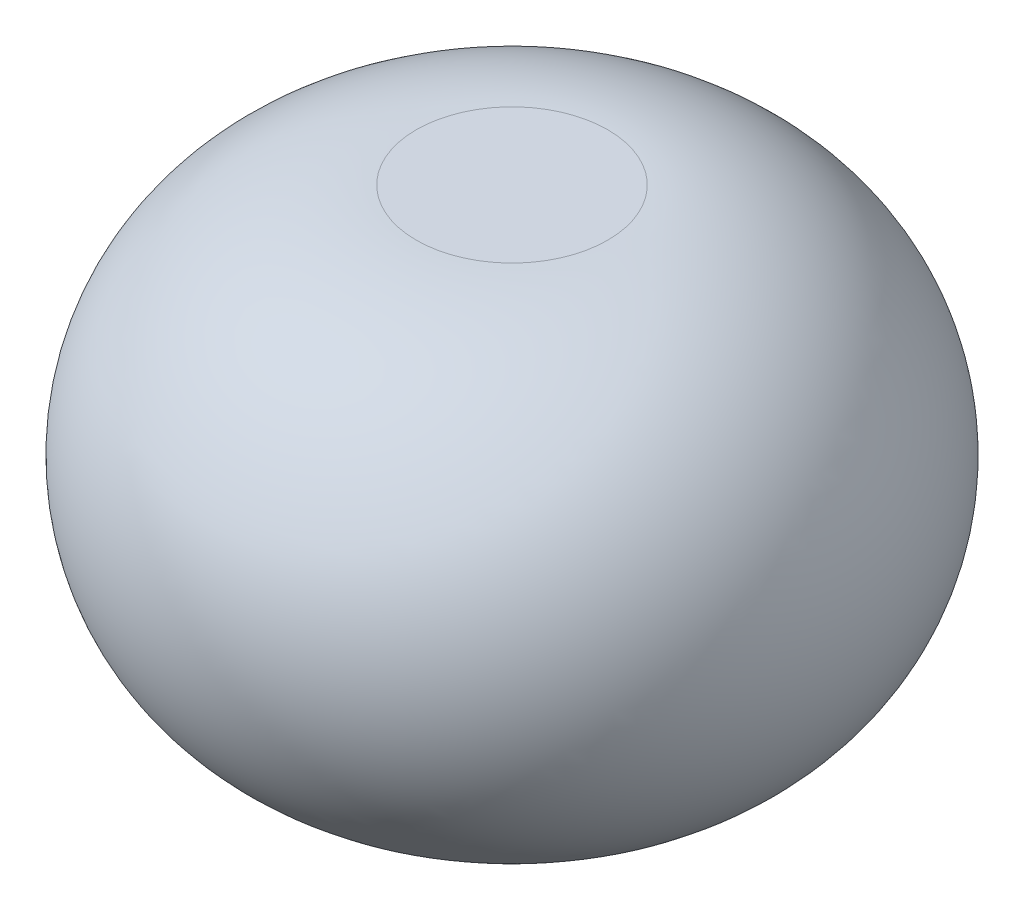
ISO-10303-21;
HEADER;
FILE_DESCRIPTION(('STEP AP214'),'2;1');
FILE_NAME('part.step','',(''),(''),'','','');
FILE_SCHEMA(('AUTOMOTIVE_DESIGN { 1 0 10303 214 1 1 1 1 }'));
ENDSEC;
DATA;
#1=APPLICATION_CONTEXT('core data for automotive mechanical design processes');
#2=APPLICATION_PROTOCOL_DEFINITION('international standard','automotive_design',2000,#1);
#3=PRODUCT_CONTEXT('',#1,'mechanical');
#4=PRODUCT('Part','Part','',(#3));
#5=PRODUCT_RELATED_PRODUCT_CATEGORY('part','',(#4));
#6=PRODUCT_DEFINITION_FORMATION('','',#4);
#7=PRODUCT_DEFINITION_CONTEXT('part definition',#1,'design');
#8=PRODUCT_DEFINITION('design','',#6,#7);
#9=PRODUCT_DEFINITION_SHAPE('','',#8);
#10=(LENGTH_UNIT() NAMED_UNIT(*) SI_UNIT(.MILLI.,.METRE.));
#11=(NAMED_UNIT(*) PLANE_ANGLE_UNIT() SI_UNIT($,.RADIAN.));
#12=(NAMED_UNIT(*) SI_UNIT($,.STERADIAN.) SOLID_ANGLE_UNIT());
#13=UNCERTAINTY_MEASURE_WITH_UNIT(LENGTH_MEASURE(1.E-05),#10,'distance_accuracy_value','');
#14=(GEOMETRIC_REPRESENTATION_CONTEXT(3) GLOBAL_UNCERTAINTY_ASSIGNED_CONTEXT((#13)) GLOBAL_UNIT_ASSIGNED_CONTEXT((#10,
#11,#12)) REPRESENTATION_CONTEXT('',''));
#15=CARTESIAN_POINT('',(0.,0.,0.));
#16=DIRECTION('',(0.,0.,1.));
#17=DIRECTION('',(1.,0.,0.));
#18=AXIS2_PLACEMENT_3D('',#15,#16,#17);
#19=CARTESIAN_POINT('',(0.,23.,0.));
#20=DIRECTION('',(0.,1.,0.));
#21=DIRECTION('',(-1.,0.,0.));
#22=AXIS2_PLACEMENT_3D('',#19,#20,#21);
#23=PLANE('',#22);
#24=CARTESIAN_POINT('',(0.,23.,0.));
#25=DIRECTION('',(0.,-1.,0.));
#26=DIRECTION('',(1.,0.,0.));
#27=AXIS2_PLACEMENT_3D('',#24,#25,#26);
#28=CIRCLE('',#27,9.00000000000007);
#29=CARTESIAN_POINT('',(8.99999999999999,23.,0.));
#30=VERTEX_POINT('',#29);
#31=EDGE_CURVE('E10',#30,#30,#28,.T.);
#32=ORIENTED_EDGE('',*,*,#31,.F.);
#33=EDGE_LOOP('',(#32));
#34=FACE_BOUND('',#33,.T.);
#35=ADVANCED_FACE('F37',(#34),#23,.T.);
#36=CARTESIAN_POINT('',(0.,0.999999999999973,0.));
#37=DIRECTION('',(0.,-1.,0.));
#38=DIRECTION('',(1.,0.,0.));
#39=AXIS2_PLACEMENT_3D('',#36,#37,#38);
#40=DEGENERATE_TOROIDAL_SURFACE('',#39,9.,22.,.T.);
#41=ORIENTED_EDGE('',*,*,#31,.T.);
#42=EDGE_LOOP('',(#41));
#43=FACE_BOUND('',#42,.T.);
#44=CARTESIAN_POINT('',(0.,-21.,0.));
#45=DIRECTION('',(0.,-1.,0.));
#46=DIRECTION('',(1.,0.,0.));
#47=AXIS2_PLACEMENT_3D('',#44,#45,#46);
#48=CIRCLE('',#47,8.99999999999993);
#49=CARTESIAN_POINT('',(9.,-21.,0.));
#50=VERTEX_POINT('',#49);
#51=EDGE_CURVE('E43',#50,#50,#48,.T.);
#52=ORIENTED_EDGE('',*,*,#51,.F.);
#53=EDGE_LOOP('',(#52));
#54=FACE_BOUND('',#53,.T.);
#55=ADVANCED_FACE('F51',(#43,#54),#40,.T.);
#56=CARTESIAN_POINT('',(9.,-21.,0.));
#57=DIRECTION('',(0.,-1.,0.));
#58=DIRECTION('',(1.,0.,0.));
#59=AXIS2_PLACEMENT_3D('',#56,#57,#58);
#60=PLANE('',#59);
#61=ORIENTED_EDGE('',*,*,#51,.T.);
#62=EDGE_LOOP('',(#61));
#63=FACE_BOUND('',#62,.T.);
#64=ADVANCED_FACE('F49',(#63),#60,.T.);
#65=CLOSED_SHELL('',(#35,#55,#64));
#66=MANIFOLD_SOLID_BREP('B2',#65);
#67=ADVANCED_BREP_SHAPE_REPRESENTATION('',(#18,#66),#14);
#68=SHAPE_DEFINITION_REPRESENTATION(#9,#67);
ENDSEC;
END-ISO-10303-21;
